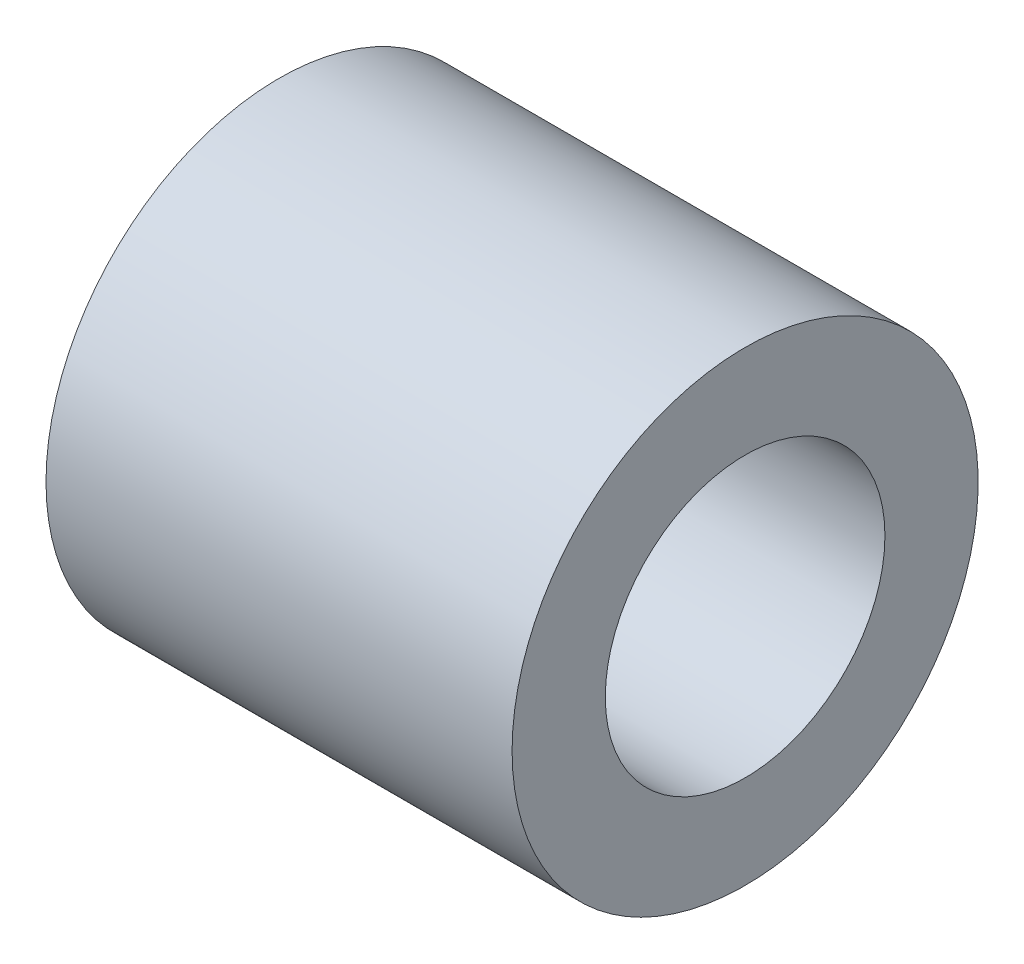
ISO-10303-21;
HEADER;
FILE_DESCRIPTION(('STEP AP214'),'2;1');
FILE_NAME('part.step','',(''),(''),'','','');
FILE_SCHEMA(('AUTOMOTIVE_DESIGN { 1 0 10303 214 1 1 1 1 }'));
ENDSEC;
DATA;
#1=APPLICATION_CONTEXT('core data for automotive mechanical design processes');
#2=APPLICATION_PROTOCOL_DEFINITION('international standard','automotive_design',2000,#1);
#3=PRODUCT_CONTEXT('',#1,'mechanical');
#4=PRODUCT('Part','Part','',(#3));
#5=PRODUCT_RELATED_PRODUCT_CATEGORY('part','',(#4));
#6=PRODUCT_DEFINITION_FORMATION('','',#4);
#7=PRODUCT_DEFINITION_CONTEXT('part definition',#1,'design');
#8=PRODUCT_DEFINITION('design','',#6,#7);
#9=PRODUCT_DEFINITION_SHAPE('','',#8);
#10=(LENGTH_UNIT() NAMED_UNIT(*) SI_UNIT(.MILLI.,.METRE.));
#11=(NAMED_UNIT(*) PLANE_ANGLE_UNIT() SI_UNIT($,.RADIAN.));
#12=(NAMED_UNIT(*) SI_UNIT($,.STERADIAN.) SOLID_ANGLE_UNIT());
#13=UNCERTAINTY_MEASURE_WITH_UNIT(LENGTH_MEASURE(1.E-05),#10,'distance_accuracy_value','');
#14=(GEOMETRIC_REPRESENTATION_CONTEXT(3) GLOBAL_UNCERTAINTY_ASSIGNED_CONTEXT((#13)) GLOBAL_UNIT_ASSIGNED_CONTEXT((#10,
#11,#12)) REPRESENTATION_CONTEXT('',''));
#15=CARTESIAN_POINT('',(0.,0.,0.));
#16=DIRECTION('',(0.,0.,1.));
#17=DIRECTION('',(1.,0.,0.));
#18=AXIS2_PLACEMENT_3D('',#15,#16,#17);
#19=CARTESIAN_POINT('',(-80.0000000000001,0.,-455.));
#20=DIRECTION('',(-1.,0.,0.));
#21=DIRECTION('',(0.,0.,1.));
#22=AXIS2_PLACEMENT_3D('',#19,#20,#21);
#23=PLANE('',#22);
#24=CARTESIAN_POINT('',(-80.0000000000001,0.,-455.));
#25=DIRECTION('',(-1.,0.,0.));
#26=DIRECTION('',(0.,0.,1.));
#27=AXIS2_PLACEMENT_3D('',#24,#25,#26);
#28=CIRCLE('',#27,25.);
#29=CARTESIAN_POINT('',(-80.0000000000001,0.,-430.));
#30=VERTEX_POINT('',#29);
#31=EDGE_CURVE('E10',#30,#30,#28,.T.);
#32=ORIENTED_EDGE('',*,*,#31,.T.);
#33=EDGE_LOOP('',(#32));
#34=FACE_BOUND('',#33,.T.);
#35=CARTESIAN_POINT('',(-80.0000000000001,0.,-455.));
#36=DIRECTION('',(-1.,0.,0.));
#37=DIRECTION('',(0.,0.,1.));
#38=AXIS2_PLACEMENT_3D('',#35,#36,#37);
#39=CIRCLE('',#38,15.);
#40=CARTESIAN_POINT('',(-80.0000000000001,0.,-440.));
#41=VERTEX_POINT('',#40);
#42=EDGE_CURVE('E43',#41,#41,#39,.T.);
#43=ORIENTED_EDGE('',*,*,#42,.F.);
#44=EDGE_LOOP('',(#43));
#45=FACE_BOUND('',#44,.T.);
#46=ADVANCED_FACE('F32',(#34,#45),#23,.T.);
#47=CARTESIAN_POINT('',(-30.,0.,-455.));
#48=DIRECTION('',(-1.,0.,0.));
#49=DIRECTION('',(0.,0.,1.));
#50=AXIS2_PLACEMENT_3D('',#47,#48,#49);
#51=PLANE('',#50);
#52=CARTESIAN_POINT('',(-30.,0.,-455.));
#53=DIRECTION('',(-1.,0.,0.));
#54=DIRECTION('',(0.,0.,1.));
#55=AXIS2_PLACEMENT_3D('',#52,#53,#54);
#56=CIRCLE('',#55,25.);
#57=CARTESIAN_POINT('',(-30.,0.,-430.));
#58=VERTEX_POINT('',#57);
#59=EDGE_CURVE('E36',#58,#58,#56,.T.);
#60=ORIENTED_EDGE('',*,*,#59,.F.);
#61=EDGE_LOOP('',(#60));
#62=FACE_BOUND('',#61,.T.);
#63=CARTESIAN_POINT('',(-30.,0.,-455.));
#64=DIRECTION('',(-1.,0.,0.));
#65=DIRECTION('',(0.,0.,1.));
#66=AXIS2_PLACEMENT_3D('',#63,#64,#65);
#67=CIRCLE('',#66,15.);
#68=CARTESIAN_POINT('',(-30.,0.,-440.));
#69=VERTEX_POINT('',#68);
#70=EDGE_CURVE('E45',#69,#69,#67,.T.);
#71=ORIENTED_EDGE('',*,*,#70,.T.);
#72=EDGE_LOOP('',(#71));
#73=FACE_BOUND('',#72,.T.);
#74=ADVANCED_FACE('F55',(#62,#73),#51,.F.);
#75=CARTESIAN_POINT('',(-80.0000000000001,0.,-455.));
#76=DIRECTION('',(1.,0.,0.));
#77=DIRECTION('',(0.,0.,-1.));
#78=AXIS2_PLACEMENT_3D('',#75,#76,#77);
#79=CYLINDRICAL_SURFACE('',#78,25.);
#80=ORIENTED_EDGE('',*,*,#31,.F.);
#81=EDGE_LOOP('',(#80));
#82=FACE_BOUND('',#81,.T.);
#83=ORIENTED_EDGE('',*,*,#59,.T.);
#84=EDGE_LOOP('',(#83));
#85=FACE_BOUND('',#84,.T.);
#86=ADVANCED_FACE('F34',(#82,#85),#79,.T.);
#87=CARTESIAN_POINT('',(-80.0000000000001,0.,-455.));
#88=DIRECTION('',(1.,0.,0.));
#89=DIRECTION('',(0.,0.,-1.));
#90=AXIS2_PLACEMENT_3D('',#87,#88,#89);
#91=CYLINDRICAL_SURFACE('',#90,15.);
#92=ORIENTED_EDGE('',*,*,#42,.T.);
#93=EDGE_LOOP('',(#92));
#94=FACE_BOUND('',#93,.T.);
#95=ORIENTED_EDGE('',*,*,#70,.F.);
#96=EDGE_LOOP('',(#95));
#97=FACE_BOUND('',#96,.T.);
#98=ADVANCED_FACE('F51',(#94,#97),#91,.F.);
#99=CLOSED_SHELL('',(#46,#74,#86,#98));
#100=MANIFOLD_SOLID_BREP('B2',#99);
#101=ADVANCED_BREP_SHAPE_REPRESENTATION('',(#18,#100),#14);
#102=SHAPE_DEFINITION_REPRESENTATION(#9,#101);
ENDSEC;
END-ISO-10303-21;
